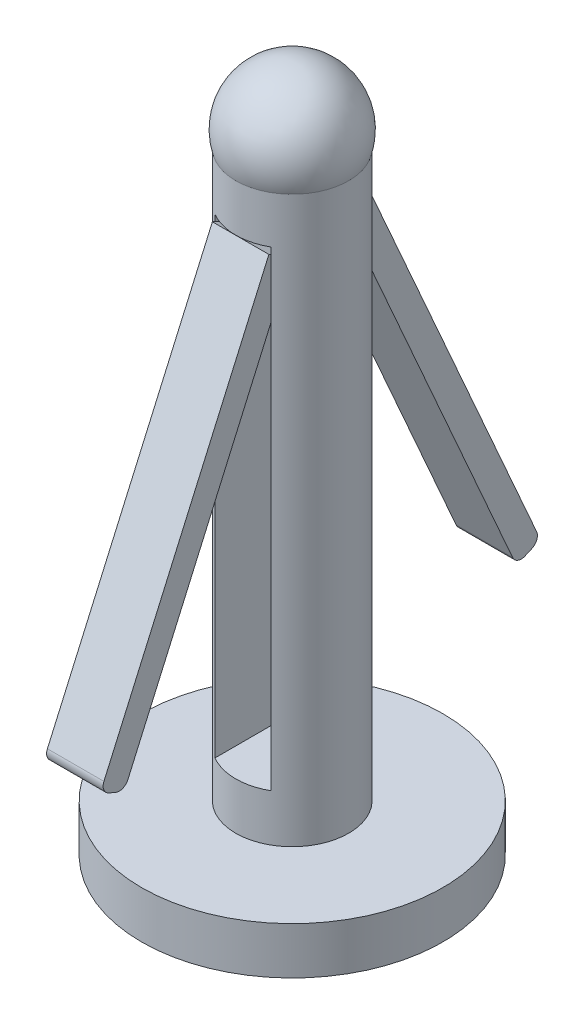
ISO-10303-21;
HEADER;
FILE_DESCRIPTION(('STEP AP214'),'2;1');
FILE_NAME('part.step','',(''),(''),'','','');
FILE_SCHEMA(('AUTOMOTIVE_DESIGN { 1 0 10303 214 1 1 1 1 }'));
ENDSEC;
DATA;
#1=APPLICATION_CONTEXT('core data for automotive mechanical design processes');
#2=APPLICATION_PROTOCOL_DEFINITION('international standard','automotive_design',2000,#1);
#3=PRODUCT_CONTEXT('',#1,'mechanical');
#4=PRODUCT('Part','Part','',(#3));
#5=PRODUCT_RELATED_PRODUCT_CATEGORY('part','',(#4));
#6=PRODUCT_DEFINITION_FORMATION('','',#4);
#7=PRODUCT_DEFINITION_CONTEXT('part definition',#1,'design');
#8=PRODUCT_DEFINITION('design','',#6,#7);
#9=PRODUCT_DEFINITION_SHAPE('','',#8);
#10=(LENGTH_UNIT() NAMED_UNIT(*) SI_UNIT(.MILLI.,.METRE.));
#11=(NAMED_UNIT(*) PLANE_ANGLE_UNIT() SI_UNIT($,.RADIAN.));
#12=(NAMED_UNIT(*) SI_UNIT($,.STERADIAN.) SOLID_ANGLE_UNIT());
#13=UNCERTAINTY_MEASURE_WITH_UNIT(LENGTH_MEASURE(1.E-05),#10,'distance_accuracy_value','');
#14=(GEOMETRIC_REPRESENTATION_CONTEXT(3) GLOBAL_UNCERTAINTY_ASSIGNED_CONTEXT((#13)) GLOBAL_UNIT_ASSIGNED_CONTEXT((#10,
#11,#12)) REPRESENTATION_CONTEXT('',''));
#15=CARTESIAN_POINT('',(0.,0.,0.));
#16=DIRECTION('',(0.,0.,1.));
#17=DIRECTION('',(1.,0.,0.));
#18=AXIS2_PLACEMENT_3D('',#15,#16,#17);
#19=CARTESIAN_POINT('',(-3.0237591290621,14.0271805623324,-21.346207791417));
#20=DIRECTION('',(1.,0.,0.));
#21=DIRECTION('',(0.,1.,0.));
#22=AXIS2_PLACEMENT_3D('',#19,#20,#21);
#23=CYLINDRICAL_SURFACE('',#22,1.);
#24=DIRECTION('',(1.,0.,0.));
#25=VECTOR('',#24,1.);
#26=CARTESIAN_POINT('',(-3.0237591290621,13.6235064220948,-20.4313049613288));
#27=LINE('',#26,#25);
#28=CARTESIAN_POINT('',(-3.0237591290621,13.6235064220948,-20.4313049613288));
#29=VERTEX_POINT('',#28);
#30=CARTESIAN_POINT('',(2.9762408709379,13.6235064220948,-20.4313049613288));
#31=VERTEX_POINT('',#30);
#32=EDGE_CURVE('E326',#29,#31,#27,.T.);
#33=ORIENTED_EDGE('',*,*,#32,.F.);
#34=CARTESIAN_POINT('',(-3.0237591290621,14.0271805623324,-21.346207791417));
#35=DIRECTION('',(1.,0.,0.));
#36=DIRECTION('',(0.,1.,0.));
#37=AXIS2_PLACEMENT_3D('',#34,#35,#36);
#38=CIRCLE('',#37,1.);
#39=CARTESIAN_POINT('',(-3.0237591290621,13.1122777322441,-21.7498819316545));
#40=VERTEX_POINT('',#39);
#41=EDGE_CURVE('E41',#40,#29,#38,.F.);
#42=ORIENTED_EDGE('',*,*,#41,.F.);
#43=DIRECTION('',(1.,0.,0.));
#44=VECTOR('',#43,1.);
#45=CARTESIAN_POINT('',(-3.0237591290621,13.1122777322441,-21.7498819316545));
#46=LINE('',#45,#44);
#47=CARTESIAN_POINT('',(2.9762408709379,13.1122777322441,-21.7498819316545));
#48=VERTEX_POINT('',#47);
#49=EDGE_CURVE('E329',#48,#40,#46,.F.);
#50=ORIENTED_EDGE('',*,*,#49,.F.);
#51=CARTESIAN_POINT('',(2.9762408709379,14.0271805623324,-21.346207791417));
#52=DIRECTION('',(1.,0.,0.));
#53=DIRECTION('',(0.,1.,0.));
#54=AXIS2_PLACEMENT_3D('',#51,#52,#53);
#55=CIRCLE('',#54,1.);
#56=EDGE_CURVE('E11',#31,#48,#55,.T.);
#57=ORIENTED_EDGE('',*,*,#56,.F.);
#58=EDGE_LOOP('',(#33,#42,#50,#57));
#59=FACE_BOUND('',#58,.T.);
#60=ADVANCED_FACE('F34',(#59),#23,.T.);
#61=CARTESIAN_POINT('',(-3.0237591290621,14.3406013358795,-22.0565568679222));
#62=DIRECTION('',(-1.,0.,0.));
#63=DIRECTION('',(0.,-1.,0.));
#64=AXIS2_PLACEMENT_3D('',#61,#62,#63);
#65=CYLINDRICAL_SURFACE('',#64,1.);
#66=DIRECTION('',(-1.,0.,0.));
#67=VECTOR('',#66,1.);
#68=CARTESIAN_POINT('',(-3.0237591290621,14.7442754761171,-22.9714596980105));
#69=LINE('',#68,#67);
#70=CARTESIAN_POINT('',(2.9762408709379,14.7442754761171,-22.9714596980105));
#71=VERTEX_POINT('',#70);
#72=CARTESIAN_POINT('',(-3.0237591290621,14.7442754761171,-22.9714596980105));
#73=VERTEX_POINT('',#72);
#74=EDGE_CURVE('E315',#71,#73,#69,.T.);
#75=ORIENTED_EDGE('',*,*,#74,.F.);
#76=CARTESIAN_POINT('',(2.9762408709379,14.3406013358795,-22.0565568679222));
#77=DIRECTION('',(1.,0.,0.));
#78=DIRECTION('',(0.,1.,0.));
#79=AXIS2_PLACEMENT_3D('',#76,#77,#78);
#80=CIRCLE('',#79,1.);
#81=CARTESIAN_POINT('',(2.9762408709379,13.4256985057913,-22.4602310081598));
#82=VERTEX_POINT('',#81);
#83=EDGE_CURVE('E321',#82,#71,#80,.T.);
#84=ORIENTED_EDGE('',*,*,#83,.F.);
#85=DIRECTION('',(-1.,0.,0.));
#86=VECTOR('',#85,1.);
#87=CARTESIAN_POINT('',(-3.0237591290621,13.4256985057913,-22.4602310081598));
#88=LINE('',#87,#86);
#89=CARTESIAN_POINT('',(-3.0237591290621,13.4256985057913,-22.4602310081598));
#90=VERTEX_POINT('',#89);
#91=EDGE_CURVE('E318',#90,#82,#88,.F.);
#92=ORIENTED_EDGE('',*,*,#91,.F.);
#93=CARTESIAN_POINT('',(-3.0237591290621,14.3406013358795,-22.0565568679222));
#94=DIRECTION('',(1.,0.,0.));
#95=DIRECTION('',(0.,1.,0.));
#96=AXIS2_PLACEMENT_3D('',#93,#94,#95);
#97=CIRCLE('',#96,1.);
#98=EDGE_CURVE('E323',#73,#90,#97,.F.);
#99=ORIENTED_EDGE('',*,*,#98,.F.);
#100=EDGE_LOOP('',(#75,#84,#92,#99));
#101=FACE_BOUND('',#100,.T.);
#102=ADVANCED_FACE('F404',(#101),#65,.T.);
#103=CARTESIAN_POINT('',(-3.0237591290621,14.0271805623324,21.346207791417));
#104=DIRECTION('',(-1.,0.,0.));
#105=DIRECTION('',(0.,-1.,0.));
#106=AXIS2_PLACEMENT_3D('',#103,#104,#105);
#107=CYLINDRICAL_SURFACE('',#106,1.);
#108=DIRECTION('',(-1.,0.,0.));
#109=VECTOR('',#108,1.);
#110=CARTESIAN_POINT('',(-3.0237591290621,13.6235064220948,20.4313049613288));
#111=LINE('',#110,#109);
#112=CARTESIAN_POINT('',(2.9762408709379,13.6235064220948,20.4313049613288));
#113=VERTEX_POINT('',#112);
#114=CARTESIAN_POINT('',(-3.0237591290621,13.6235064220948,20.4313049613288));
#115=VERTEX_POINT('',#114);
#116=EDGE_CURVE('E305',#113,#115,#111,.T.);
#117=ORIENTED_EDGE('',*,*,#116,.F.);
#118=CARTESIAN_POINT('',(2.9762408709379,14.0271805623324,21.346207791417));
#119=DIRECTION('',(1.,0.,0.));
#120=DIRECTION('',(0.,1.,0.));
#121=AXIS2_PLACEMENT_3D('',#118,#119,#120);
#122=CIRCLE('',#121,1.);
#123=CARTESIAN_POINT('',(2.9762408709379,13.1122777322441,21.7498819316545));
#124=VERTEX_POINT('',#123);
#125=EDGE_CURVE('E311',#124,#113,#122,.T.);
#126=ORIENTED_EDGE('',*,*,#125,.F.);
#127=DIRECTION('',(-1.,0.,0.));
#128=VECTOR('',#127,1.);
#129=CARTESIAN_POINT('',(-3.0237591290621,13.1122777322441,21.7498819316545));
#130=LINE('',#129,#128);
#131=CARTESIAN_POINT('',(-3.0237591290621,13.1122777322441,21.7498819316545));
#132=VERTEX_POINT('',#131);
#133=EDGE_CURVE('E308',#132,#124,#130,.F.);
#134=ORIENTED_EDGE('',*,*,#133,.F.);
#135=CARTESIAN_POINT('',(-3.0237591290621,14.0271805623324,21.346207791417));
#136=DIRECTION('',(1.,0.,0.));
#137=DIRECTION('',(0.,1.,0.));
#138=AXIS2_PLACEMENT_3D('',#135,#136,#137);
#139=CIRCLE('',#138,1.);
#140=EDGE_CURVE('E313',#115,#132,#139,.F.);
#141=ORIENTED_EDGE('',*,*,#140,.F.);
#142=EDGE_LOOP('',(#117,#126,#134,#141));
#143=FACE_BOUND('',#142,.T.);
#144=ADVANCED_FACE('F379',(#143),#107,.T.);
#145=CARTESIAN_POINT('',(-3.0237591290621,14.3406013358795,22.0565568679222));
#146=DIRECTION('',(1.,0.,0.));
#147=DIRECTION('',(0.,1.,0.));
#148=AXIS2_PLACEMENT_3D('',#145,#146,#147);
#149=CYLINDRICAL_SURFACE('',#148,1.);
#150=DIRECTION('',(1.,0.,0.));
#151=VECTOR('',#150,1.);
#152=CARTESIAN_POINT('',(-3.0237591290621,14.7442754761171,22.9714596980105));
#153=LINE('',#152,#151);
#154=CARTESIAN_POINT('',(-3.0237591290621,14.7442754761171,22.9714596980105));
#155=VERTEX_POINT('',#154);
#156=CARTESIAN_POINT('',(2.9762408709379,14.7442754761171,22.9714596980105));
#157=VERTEX_POINT('',#156);
#158=EDGE_CURVE('E294',#155,#157,#153,.T.);
#159=ORIENTED_EDGE('',*,*,#158,.F.);
#160=CARTESIAN_POINT('',(-3.0237591290621,14.3406013358795,22.0565568679222));
#161=DIRECTION('',(1.,0.,0.));
#162=DIRECTION('',(0.,1.,0.));
#163=AXIS2_PLACEMENT_3D('',#160,#161,#162);
#164=CIRCLE('',#163,1.);
#165=CARTESIAN_POINT('',(-3.0237591290621,13.4256985057913,22.4602310081598));
#166=VERTEX_POINT('',#165);
#167=EDGE_CURVE('E300',#166,#155,#164,.F.);
#168=ORIENTED_EDGE('',*,*,#167,.F.);
#169=DIRECTION('',(1.,0.,0.));
#170=VECTOR('',#169,1.);
#171=CARTESIAN_POINT('',(-3.0237591290621,13.4256985057913,22.4602310081598));
#172=LINE('',#171,#170);
#173=CARTESIAN_POINT('',(2.9762408709379,13.4256985057913,22.4602310081598));
#174=VERTEX_POINT('',#173);
#175=EDGE_CURVE('E297',#174,#166,#172,.F.);
#176=ORIENTED_EDGE('',*,*,#175,.F.);
#177=CARTESIAN_POINT('',(2.9762408709379,14.3406013358795,22.0565568679222));
#178=DIRECTION('',(1.,0.,0.));
#179=DIRECTION('',(0.,1.,0.));
#180=AXIS2_PLACEMENT_3D('',#177,#178,#179);
#181=CIRCLE('',#180,1.);
#182=EDGE_CURVE('E302',#157,#174,#181,.T.);
#183=ORIENTED_EDGE('',*,*,#182,.F.);
#184=EDGE_LOOP('',(#159,#168,#176,#183));
#185=FACE_BOUND('',#184,.T.);
#186=ADVANCED_FACE('F372',(#185),#149,.T.);
#187=CARTESIAN_POINT('',(-3.0237591290621,55.,-6.));
#188=DIRECTION('',(-1.,0.,0.));
#189=DIRECTION('',(0.,-1.,0.));
#190=AXIS2_PLACEMENT_3D('',#187,#188,#189);
#191=PLANE('',#190);
#192=DIRECTION('',(0.,-1.,0.));
#193=VECTOR('',#192,1.);
#194=CARTESIAN_POINT('',(-3.0237591290621,60.,-5.18236246603936));
#195=LINE('',#194,#193);
#196=CARTESIAN_POINT('',(-3.0237591290621,48.1843049824975,-5.18236246603936));
#197=VERTEX_POINT('',#196);
#198=CARTESIAN_POINT('',(-3.0237591290621,5.,-5.18236246603937));
#199=VERTEX_POINT('',#198);
#200=EDGE_CURVE('E196',#197,#199,#195,.T.);
#201=ORIENTED_EDGE('',*,*,#200,.F.);
#202=DIRECTION('',(0.,-0.914902830088248,-0.403674140237536));
#203=VECTOR('',#202,1.);
#204=CARTESIAN_POINT('',(-3.0237591290621,12.7086035920066,-20.8349791015663));
#205=LINE('',#204,#203);
#206=CARTESIAN_POINT('',(-3.0237591290621,53.3243296930876,-2.91447675445292));
#207=VERTEX_POINT('',#206);
#208=EDGE_CURVE('E180',#207,#197,#205,.T.);
#209=ORIENTED_EDGE('',*,*,#208,.F.);
#210=DIRECTION('',(0.,-0.403674140237535,0.914902830088249));
#211=VECTOR('',#210,1.);
#212=CARTESIAN_POINT('',(-3.0237591290621,54.4450987471099,-5.45463149113464));
#213=LINE('',#212,#211);
#214=CARTESIAN_POINT('',(-3.0237591290621,54.3249679955108,-5.18236246603936));
#215=VERTEX_POINT('',#214);
#216=EDGE_CURVE('E167',#215,#207,#213,.T.);
#217=ORIENTED_EDGE('',*,*,#216,.F.);
#218=CARTESIAN_POINT('',(-3.0237591290621,55.,-5.18236246603936));
#219=VERTEX_POINT('',#218);
#220=EDGE_CURVE('E278',#219,#215,#195,.T.);
#221=ORIENTED_EDGE('',*,*,#220,.F.);
#222=DIRECTION('',(0.,0.,1.));
#223=VECTOR('',#222,1.);
#224=CARTESIAN_POINT('',(-3.0237591290621,55.,-6.));
#225=LINE('',#224,#223);
#226=CARTESIAN_POINT('',(-3.0237591290621,55.,5.18236246603936));
#227=VERTEX_POINT('',#226);
#228=EDGE_CURVE('E244',#219,#227,#225,.T.);
#229=ORIENTED_EDGE('',*,*,#228,.T.);
#230=DIRECTION('',(0.,-1.,0.));
#231=VECTOR('',#230,1.);
#232=CARTESIAN_POINT('',(-3.0237591290621,60.,5.18236246603936));
#233=LINE('',#232,#231);
#234=CARTESIAN_POINT('',(-3.0237591290621,54.3249679955108,5.18236246603937));
#235=VERTEX_POINT('',#234);
#236=EDGE_CURVE('E272',#235,#227,#233,.F.);
#237=ORIENTED_EDGE('',*,*,#236,.F.);
#238=DIRECTION('',(0.,-0.403674140237535,-0.914902830088249));
#239=VECTOR('',#238,1.);
#240=CARTESIAN_POINT('',(-3.0237591290621,54.4450987471099,5.45463149113464));
#241=LINE('',#240,#239);
#242=CARTESIAN_POINT('',(-3.0237591290621,53.3243296930876,2.91447675445292));
#243=VERTEX_POINT('',#242);
#244=EDGE_CURVE('E221',#235,#243,#241,.T.);
#245=ORIENTED_EDGE('',*,*,#244,.T.);
#246=DIRECTION('',(0.,-0.914902830088248,0.403674140237536));
#247=VECTOR('',#246,1.);
#248=CARTESIAN_POINT('',(-3.0237591290621,12.7086035920066,20.8349791015663));
#249=LINE('',#248,#247);
#250=CARTESIAN_POINT('',(-3.0237591290621,48.1843049824975,5.18236246603936));
#251=VERTEX_POINT('',#250);
#252=EDGE_CURVE('E226',#243,#251,#249,.T.);
#253=ORIENTED_EDGE('',*,*,#252,.T.);
#254=CARTESIAN_POINT('',(-3.0237591290621,5.,5.18236246603937));
#255=VERTEX_POINT('',#254);
#256=EDGE_CURVE('E274',#255,#251,#233,.F.);
#257=ORIENTED_EDGE('',*,*,#256,.F.);
#258=DIRECTION('',(0.,0.,1.));
#259=VECTOR('',#258,1.);
#260=CARTESIAN_POINT('',(-3.0237591290621,5.,-6.));
#261=LINE('',#260,#259);
#262=EDGE_CURVE('E243',#199,#255,#261,.T.);
#263=ORIENTED_EDGE('',*,*,#262,.F.);
#264=EDGE_LOOP('',(#201,#209,#217,#221,#229,#237,#245,#253,#257,#263));
#265=FACE_BOUND('',#264,.T.);
#266=ADVANCED_FACE('F194',(#265),#191,.F.);
#267=CARTESIAN_POINT('',(2.9762408709379,55.,-6.));
#268=DIRECTION('',(1.,0.,0.));
#269=DIRECTION('',(0.,1.,0.));
#270=AXIS2_PLACEMENT_3D('',#267,#268,#269);
#271=PLANE('',#270);
#272=DIRECTION('',(0.,-0.403674140237535,0.914902830088249));
#273=VECTOR('',#272,1.);
#274=CARTESIAN_POINT('',(2.9762408709379,54.4450987471099,-5.45463149113464));
#275=LINE('',#274,#273);
#276=CARTESIAN_POINT('',(2.9762408709379,54.3370729147514,-5.2097975275589));
#277=VERTEX_POINT('',#276);
#278=CARTESIAN_POINT('',(2.9762408709379,53.3243296930876,-2.91447675445292));
#279=VERTEX_POINT('',#278);
#280=EDGE_CURVE('E209',#277,#279,#275,.T.);
#281=ORIENTED_EDGE('',*,*,#280,.T.);
#282=DIRECTION('',(0.,-0.914902830088248,-0.403674140237536));
#283=VECTOR('',#282,1.);
#284=CARTESIAN_POINT('',(2.9762408709379,12.7086035920066,-20.8349791015663));
#285=LINE('',#284,#283);
#286=CARTESIAN_POINT('',(2.9762408709379,48.1221250880581,-5.20979752755891));
#287=VERTEX_POINT('',#286);
#288=EDGE_CURVE('E188',#279,#287,#285,.T.);
#289=ORIENTED_EDGE('',*,*,#288,.T.);
#290=DIRECTION('',(0.,-1.,0.));
#291=VECTOR('',#290,1.);
#292=CARTESIAN_POINT('',(2.9762408709379,60.,-5.2097975275589));
#293=LINE('',#292,#291);
#294=CARTESIAN_POINT('',(2.9762408709379,5.,-5.2097975275589));
#295=VERTEX_POINT('',#294);
#296=EDGE_CURVE('E287',#295,#287,#293,.F.);
#297=ORIENTED_EDGE('',*,*,#296,.F.);
#298=DIRECTION('',(0.,0.,1.));
#299=VECTOR('',#298,1.);
#300=CARTESIAN_POINT('',(2.9762408709379,5.,-6.));
#301=LINE('',#300,#299);
#302=CARTESIAN_POINT('',(2.9762408709379,5.,5.2097975275589));
#303=VERTEX_POINT('',#302);
#304=EDGE_CURVE('E251',#295,#303,#301,.T.);
#305=ORIENTED_EDGE('',*,*,#304,.T.);
#306=DIRECTION('',(0.,-1.,0.));
#307=VECTOR('',#306,1.);
#308=CARTESIAN_POINT('',(2.9762408709379,60.,5.2097975275589));
#309=LINE('',#308,#307);
#310=CARTESIAN_POINT('',(2.9762408709379,48.1221250880582,5.2097975275589));
#311=VERTEX_POINT('',#310);
#312=EDGE_CURVE('E280',#311,#303,#309,.T.);
#313=ORIENTED_EDGE('',*,*,#312,.F.);
#314=DIRECTION('',(0.,-0.914902830088248,0.403674140237536));
#315=VECTOR('',#314,1.);
#316=CARTESIAN_POINT('',(2.9762408709379,12.7086035920066,20.8349791015663));
#317=LINE('',#316,#315);
#318=CARTESIAN_POINT('',(2.9762408709379,53.3243296930876,2.91447675445292));
#319=VERTEX_POINT('',#318);
#320=EDGE_CURVE('E219',#319,#311,#317,.T.);
#321=ORIENTED_EDGE('',*,*,#320,.F.);
#322=DIRECTION('',(0.,-0.403674140237536,-0.914902830088249));
#323=VECTOR('',#322,1.);
#324=CARTESIAN_POINT('',(2.9762408709379,50.3050670292558,-3.92849801300188));
#325=LINE('',#324,#323);
#326=CARTESIAN_POINT('',(2.9762408709379,54.3370729147514,5.20979752755891));
#327=VERTEX_POINT('',#326);
#328=EDGE_CURVE('E290',#327,#319,#325,.T.);
#329=ORIENTED_EDGE('',*,*,#328,.F.);
#330=CARTESIAN_POINT('',(2.9762408709379,55.,5.2097975275589));
#331=VERTEX_POINT('',#330);
#332=EDGE_CURVE('E282',#331,#327,#309,.T.);
#333=ORIENTED_EDGE('',*,*,#332,.F.);
#334=DIRECTION('',(0.,0.,1.));
#335=VECTOR('',#334,1.);
#336=CARTESIAN_POINT('',(2.9762408709379,55.,-6.));
#337=LINE('',#336,#335);
#338=CARTESIAN_POINT('',(2.9762408709379,55.,-5.2097975275589));
#339=VERTEX_POINT('',#338);
#340=EDGE_CURVE('E248',#339,#331,#337,.T.);
#341=ORIENTED_EDGE('',*,*,#340,.F.);
#342=EDGE_CURVE('E285',#277,#339,#293,.F.);
#343=ORIENTED_EDGE('',*,*,#342,.F.);
#344=EDGE_LOOP('',(#281,#289,#297,#305,#313,#321,#329,#333,#341,#343));
#345=FACE_BOUND('',#344,.T.);
#346=ADVANCED_FACE('F348',(#345),#271,.F.);
#347=CARTESIAN_POINT('',(0.,0.,0.));
#348=DIRECTION('',(0.,1.,0.));
#349=DIRECTION('',(0.,0.,1.));
#350=AXIS2_PLACEMENT_3D('',#347,#348,#349);
#351=PLANE('',#350);
#352=CARTESIAN_POINT('',(0.,0.,0.));
#353=DIRECTION('',(0.,1.,0.));
#354=DIRECTION('',(0.,0.,1.));
#355=AXIS2_PLACEMENT_3D('',#352,#353,#354);
#356=CIRCLE('',#355,16.);
#357=CARTESIAN_POINT('',(0.,0.,16.));
#358=VERTEX_POINT('',#357);
#359=EDGE_CURVE('E262',#358,#358,#356,.T.);
#360=ORIENTED_EDGE('',*,*,#359,.T.);
#361=EDGE_LOOP('',(#360));
#362=FACE_BOUND('',#361,.T.);
#363=CARTESIAN_POINT('',(0.,0.,0.));
#364=DIRECTION('',(0.,1.,0.));
#365=DIRECTION('',(0.,0.,1.));
#366=AXIS2_PLACEMENT_3D('',#363,#364,#365);
#367=CIRCLE('',#366,6.);
#368=CARTESIAN_POINT('',(0.,0.,6.));
#369=VERTEX_POINT('',#368);
#370=EDGE_CURVE('E247',#369,#369,#367,.T.);
#371=ORIENTED_EDGE('',*,*,#370,.F.);
#372=EDGE_LOOP('',(#371));
#373=FACE_BOUND('',#372,.T.);
#374=ADVANCED_FACE('F436',(#362,#373),#351,.T.);
#375=CARTESIAN_POINT('',(0.,-5.,0.));
#376=DIRECTION('',(0.,1.,0.));
#377=DIRECTION('',(0.,0.,1.));
#378=AXIS2_PLACEMENT_3D('',#375,#376,#377);
#379=CYLINDRICAL_SURFACE('',#378,16.);
#380=CARTESIAN_POINT('',(0.,-5.,0.));
#381=DIRECTION('',(0.,1.,0.));
#382=DIRECTION('',(0.,0.,1.));
#383=AXIS2_PLACEMENT_3D('',#380,#381,#382);
#384=CIRCLE('',#383,16.);
#385=CARTESIAN_POINT('',(0.,-5.,16.));
#386=VERTEX_POINT('',#385);
#387=EDGE_CURVE('E258',#386,#386,#384,.T.);
#388=ORIENTED_EDGE('',*,*,#387,.T.);
#389=EDGE_LOOP('',(#388));
#390=FACE_BOUND('',#389,.T.);
#391=ORIENTED_EDGE('',*,*,#359,.F.);
#392=EDGE_LOOP('',(#391));
#393=FACE_BOUND('',#392,.T.);
#394=ADVANCED_FACE('F432',(#390,#393),#379,.T.);
#395=CARTESIAN_POINT('',(0.,-5.,0.));
#396=DIRECTION('',(0.,1.,0.));
#397=DIRECTION('',(0.,0.,1.));
#398=AXIS2_PLACEMENT_3D('',#395,#396,#397);
#399=PLANE('',#398);
#400=ORIENTED_EDGE('',*,*,#387,.F.);
#401=EDGE_LOOP('',(#400));
#402=FACE_BOUND('',#401,.T.);
#403=ADVANCED_FACE('F435',(#402),#399,.F.);
#404=CARTESIAN_POINT('',(0.,60.,0.));
#405=DIRECTION('',(0.,-1.,0.));
#406=DIRECTION('',(0.,0.,-1.));
#407=AXIS2_PLACEMENT_3D('',#404,#405,#406);
#408=CYLINDRICAL_SURFACE('',#407,6.);
#409=ORIENTED_EDGE('',*,*,#296,.T.);
#410=EDGE_CURVE('E291',#287,#277,#293,.F.);
#411=ORIENTED_EDGE('',*,*,#410,.T.);
#412=ORIENTED_EDGE('',*,*,#342,.T.);
#413=CARTESIAN_POINT('',(0.,55.,0.));
#414=DIRECTION('',(0.,1.,0.));
#415=DIRECTION('',(0.,0.,1.));
#416=AXIS2_PLACEMENT_3D('',#413,#414,#415);
#417=CIRCLE('',#416,6.);
#418=EDGE_CURVE('E273',#339,#219,#417,.T.);
#419=ORIENTED_EDGE('',*,*,#418,.T.);
#420=ORIENTED_EDGE('',*,*,#220,.T.);
#421=EDGE_CURVE('E281',#215,#197,#195,.T.);
#422=ORIENTED_EDGE('',*,*,#421,.T.);
#423=ORIENTED_EDGE('',*,*,#200,.T.);
#424=CARTESIAN_POINT('',(0.,5.,0.));
#425=DIRECTION('',(0.,-1.,0.));
#426=DIRECTION('',(0.,0.,-1.));
#427=AXIS2_PLACEMENT_3D('',#424,#425,#426);
#428=CIRCLE('',#427,6.);
#429=EDGE_CURVE('E270',#199,#295,#428,.T.);
#430=ORIENTED_EDGE('',*,*,#429,.T.);
#431=EDGE_LOOP('',(#409,#411,#412,#419,#420,#422,#423,#430));
#432=FACE_BOUND('',#431,.T.);
#433=EDGE_CURVE('E269',#227,#331,#417,.T.);
#434=ORIENTED_EDGE('',*,*,#433,.T.);
#435=ORIENTED_EDGE('',*,*,#332,.T.);
#436=EDGE_CURVE('E286',#327,#311,#309,.T.);
#437=ORIENTED_EDGE('',*,*,#436,.T.);
#438=ORIENTED_EDGE('',*,*,#312,.T.);
#439=EDGE_CURVE('E261',#303,#255,#428,.T.);
#440=ORIENTED_EDGE('',*,*,#439,.T.);
#441=ORIENTED_EDGE('',*,*,#256,.T.);
#442=EDGE_CURVE('E277',#251,#235,#233,.F.);
#443=ORIENTED_EDGE('',*,*,#442,.T.);
#444=ORIENTED_EDGE('',*,*,#236,.T.);
#445=EDGE_LOOP('',(#434,#435,#437,#438,#440,#441,#443,#444));
#446=FACE_BOUND('',#445,.T.);
#447=CARTESIAN_POINT('',(0.,60.,0.));
#448=DIRECTION('',(0.,1.,0.));
#449=DIRECTION('',(0.,0.,1.));
#450=AXIS2_PLACEMENT_3D('',#447,#448,#449);
#451=CIRCLE('',#450,6.);
#452=CARTESIAN_POINT('',(0.,60.,6.));
#453=VERTEX_POINT('',#452);
#454=EDGE_CURVE('E257',#453,#453,#451,.T.);
#455=ORIENTED_EDGE('',*,*,#454,.F.);
#456=EDGE_LOOP('',(#455));
#457=FACE_BOUND('',#456,.T.);
#458=ORIENTED_EDGE('',*,*,#370,.T.);
#459=EDGE_LOOP('',(#458));
#460=FACE_BOUND('',#459,.T.);
#461=ADVANCED_FACE('F339',(#432,#446,#457,#460),#408,.T.);
#462=CARTESIAN_POINT('',(0.,61.75,0.));
#463=DIRECTION('',(0.,0.,1.));
#464=DIRECTION('',(1.,0.,0.));
#465=AXIS2_PLACEMENT_3D('',#462,#463,#464);
#466=SPHERICAL_SURFACE('',#465,6.25);
#467=CARTESIAN_POINT('',(0.,61.75,0.));
#468=DIRECTION('',(0.,1.,0.));
#469=DIRECTION('',(0.,0.,1.));
#470=AXIS2_PLACEMENT_3D('',#467,#468,#469);
#471=SPHERICAL_SURFACE('',#470,6.25);
#472=ORIENTED_EDGE('',*,*,#454,.T.);
#473=EDGE_LOOP('',(#472));
#474=FACE_BOUND('',#473,.T.);
#475=ADVANCED_FACE('F428',(#474),#471,.T.);
#476=CARTESIAN_POINT('',(2.9762408709379,55.,-6.));
#477=DIRECTION('',(0.,1.,0.));
#478=DIRECTION('',(0.,0.,1.));
#479=AXIS2_PLACEMENT_3D('',#476,#477,#478);
#480=PLANE('',#479);
#481=ORIENTED_EDGE('',*,*,#340,.T.);
#482=ORIENTED_EDGE('',*,*,#433,.F.);
#483=ORIENTED_EDGE('',*,*,#228,.F.);
#484=ORIENTED_EDGE('',*,*,#418,.F.);
#485=EDGE_LOOP('',(#481,#482,#483,#484));
#486=FACE_BOUND('',#485,.T.);
#487=ADVANCED_FACE('F345',(#486),#480,.F.);
#488=CARTESIAN_POINT('',(2.9762408709379,5.,-6.));
#489=DIRECTION('',(0.,-1.,0.));
#490=DIRECTION('',(0.,0.,-1.));
#491=AXIS2_PLACEMENT_3D('',#488,#489,#490);
#492=PLANE('',#491);
#493=ORIENTED_EDGE('',*,*,#304,.F.);
#494=ORIENTED_EDGE('',*,*,#429,.F.);
#495=ORIENTED_EDGE('',*,*,#262,.T.);
#496=ORIENTED_EDGE('',*,*,#439,.F.);
#497=EDGE_LOOP('',(#493,#494,#495,#496));
#498=FACE_BOUND('',#497,.T.);
#499=ADVANCED_FACE('F389',(#498),#492,.F.);
#500=CARTESIAN_POINT('',(-3.0237591290621,0.,0.));
#501=DIRECTION('',(1.,0.,0.));
#502=DIRECTION('',(0.,1.,0.));
#503=AXIS2_PLACEMENT_3D('',#500,#501,#502);
#504=PLANE('',#503);
#505=EDGE_CURVE('E225',#251,#115,#249,.T.);
#506=ORIENTED_EDGE('',*,*,#505,.T.);
#507=ORIENTED_EDGE('',*,*,#140,.T.);
#508=DIRECTION('',(0.,0.403674140237536,0.914902830088248));
#509=VECTOR('',#508,1.);
#510=CARTESIAN_POINT('',(-3.0237591290621,13.8293726460288,23.375133838248));
#511=LINE('',#510,#509);
#512=EDGE_CURVE('E216',#132,#166,#511,.T.);
#513=ORIENTED_EDGE('',*,*,#512,.T.);
#514=ORIENTED_EDGE('',*,*,#167,.T.);
#515=DIRECTION('',(0.,0.914902830088248,-0.403674140237536));
#516=VECTOR('',#515,1.);
#517=CARTESIAN_POINT('',(-3.0237591290621,54.4450987471099,5.45463149113464));
#518=LINE('',#517,#516);
#519=CARTESIAN_POINT('',(-3.0237591290621,54.4450987471099,5.45463149113464));
#520=VERTEX_POINT('',#519);
#521=EDGE_CURVE('E218',#155,#520,#518,.T.);
#522=ORIENTED_EDGE('',*,*,#521,.T.);
#523=EDGE_CURVE('E222',#520,#235,#241,.T.);
#524=ORIENTED_EDGE('',*,*,#523,.T.);
#525=ORIENTED_EDGE('',*,*,#442,.F.);
#526=EDGE_LOOP('',(#506,#507,#513,#514,#522,#524,#525));
#527=FACE_BOUND('',#526,.T.);
#528=ADVANCED_FACE('F395',(#527),#504,.F.);
#529=CARTESIAN_POINT('',(2.9762408709379,0.,0.));
#530=DIRECTION('',(1.,0.,0.));
#531=DIRECTION('',(0.,1.,0.));
#532=AXIS2_PLACEMENT_3D('',#529,#530,#531);
#533=PLANE('',#532);
#534=DIRECTION('',(0.,0.403674140237536,0.914902830088248));
#535=VECTOR('',#534,1.);
#536=CARTESIAN_POINT('',(2.9762408709379,13.8293726460288,23.375133838248));
#537=LINE('',#536,#535);
#538=EDGE_CURVE('E190',#124,#174,#537,.T.);
#539=ORIENTED_EDGE('',*,*,#538,.F.);
#540=ORIENTED_EDGE('',*,*,#125,.T.);
#541=EDGE_CURVE('E235',#311,#113,#317,.T.);
#542=ORIENTED_EDGE('',*,*,#541,.F.);
#543=ORIENTED_EDGE('',*,*,#436,.F.);
#544=DIRECTION('',(0.,-0.403674140237535,-0.914902830088249));
#545=VECTOR('',#544,1.);
#546=CARTESIAN_POINT('',(2.9762408709379,54.4450987471099,5.45463149113464));
#547=LINE('',#546,#545);
#548=CARTESIAN_POINT('',(2.9762408709379,54.4450987471099,5.45463149113464));
#549=VERTEX_POINT('',#548);
#550=EDGE_CURVE('E232',#549,#327,#547,.T.);
#551=ORIENTED_EDGE('',*,*,#550,.F.);
#552=DIRECTION('',(0.,0.914902830088248,-0.403674140237536));
#553=VECTOR('',#552,1.);
#554=CARTESIAN_POINT('',(2.9762408709379,54.4450987471099,5.45463149113464));
#555=LINE('',#554,#553);
#556=EDGE_CURVE('E230',#157,#549,#555,.T.);
#557=ORIENTED_EDGE('',*,*,#556,.F.);
#558=ORIENTED_EDGE('',*,*,#182,.T.);
#559=EDGE_LOOP('',(#539,#540,#542,#543,#551,#557,#558));
#560=FACE_BOUND('',#559,.T.);
#561=ADVANCED_FACE('F356',(#560),#533,.T.);
#562=CARTESIAN_POINT('',(-3.0237591290621,13.8293726460288,23.375133838248));
#563=DIRECTION('',(0.,0.914902830088248,-0.403674140237536));
#564=DIRECTION('',(0.,0.403674140237536,0.914902830088248));
#565=AXIS2_PLACEMENT_3D('',#562,#563,#564);
#566=PLANE('',#565);
#567=ORIENTED_EDGE('',*,*,#512,.F.);
#568=ORIENTED_EDGE('',*,*,#133,.T.);
#569=ORIENTED_EDGE('',*,*,#538,.T.);
#570=ORIENTED_EDGE('',*,*,#175,.T.);
#571=EDGE_LOOP('',(#567,#568,#569,#570));
#572=FACE_BOUND('',#571,.T.);
#573=ADVANCED_FACE('F375',(#572),#566,.F.);
#574=CARTESIAN_POINT('',(-3.0237591290621,54.4450987471099,5.45463149113464));
#575=DIRECTION('',(0.,-0.403674140237536,-0.914902830088248));
#576=DIRECTION('',(0.,0.914902830088248,-0.403674140237536));
#577=AXIS2_PLACEMENT_3D('',#574,#575,#576);
#578=PLANE('',#577);
#579=ORIENTED_EDGE('',*,*,#521,.F.);
#580=ORIENTED_EDGE('',*,*,#158,.T.);
#581=ORIENTED_EDGE('',*,*,#556,.T.);
#582=DIRECTION('',(1.,0.,0.));
#583=VECTOR('',#582,1.);
#584=CARTESIAN_POINT('',(-3.0237591290621,54.4450987471099,5.45463149113464));
#585=LINE('',#584,#583);
#586=EDGE_CURVE('E240',#520,#549,#585,.T.);
#587=ORIENTED_EDGE('',*,*,#586,.F.);
#588=EDGE_LOOP('',(#579,#580,#581,#587));
#589=FACE_BOUND('',#588,.T.);
#590=ADVANCED_FACE('F367',(#589),#578,.F.);
#591=CARTESIAN_POINT('',(-3.0237591290621,54.4450987471099,5.45463149113464));
#592=DIRECTION('',(0.,-0.914902830088248,0.403674140237535));
#593=DIRECTION('',(0.,-0.403674140237536,-0.914902830088249));
#594=AXIS2_PLACEMENT_3D('',#591,#592,#593);
#595=PLANE('',#594);
#596=ORIENTED_EDGE('',*,*,#550,.T.);
#597=ORIENTED_EDGE('',*,*,#328,.T.);
#598=DIRECTION('',(1.,0.,0.));
#599=VECTOR('',#598,1.);
#600=CARTESIAN_POINT('',(-3.0237591290621,53.3243296930876,2.91447675445292));
#601=LINE('',#600,#599);
#602=EDGE_CURVE('E228',#243,#319,#601,.T.);
#603=ORIENTED_EDGE('',*,*,#602,.F.);
#604=ORIENTED_EDGE('',*,*,#244,.F.);
#605=ORIENTED_EDGE('',*,*,#523,.F.);
#606=ORIENTED_EDGE('',*,*,#586,.T.);
#607=EDGE_LOOP('',(#596,#597,#603,#604,#605,#606));
#608=FACE_BOUND('',#607,.T.);
#609=ADVANCED_FACE('F360',(#608),#595,.F.);
#610=CARTESIAN_POINT('',(-3.0237591290621,12.7086035920066,20.8349791015663));
#611=DIRECTION('',(0.,0.403674140237536,0.914902830088248));
#612=DIRECTION('',(0.,-0.914902830088248,0.403674140237536));
#613=AXIS2_PLACEMENT_3D('',#610,#611,#612);
#614=PLANE('',#613);
#615=ORIENTED_EDGE('',*,*,#541,.T.);
#616=ORIENTED_EDGE('',*,*,#116,.T.);
#617=ORIENTED_EDGE('',*,*,#505,.F.);
#618=ORIENTED_EDGE('',*,*,#252,.F.);
#619=ORIENTED_EDGE('',*,*,#602,.T.);
#620=ORIENTED_EDGE('',*,*,#320,.T.);
#621=EDGE_LOOP('',(#615,#616,#617,#618,#619,#620));
#622=FACE_BOUND('',#621,.T.);
#623=ADVANCED_FACE('F383',(#622),#614,.F.);
#624=CARTESIAN_POINT('',(-3.0237591290621,0.,0.));
#625=DIRECTION('',(1.,0.,0.));
#626=DIRECTION('',(0.,1.,0.));
#627=AXIS2_PLACEMENT_3D('',#624,#625,#626);
#628=PLANE('',#627);
#629=DIRECTION('',(0.,0.403674140237536,-0.914902830088248));
#630=VECTOR('',#629,1.);
#631=CARTESIAN_POINT('',(-3.0237591290621,13.8293726460288,-23.375133838248));
#632=LINE('',#631,#630);
#633=EDGE_CURVE('E200',#40,#90,#632,.T.);
#634=ORIENTED_EDGE('',*,*,#633,.F.);
#635=ORIENTED_EDGE('',*,*,#41,.T.);
#636=EDGE_CURVE('E198',#197,#29,#205,.T.);
#637=ORIENTED_EDGE('',*,*,#636,.F.);
#638=ORIENTED_EDGE('',*,*,#421,.F.);
#639=CARTESIAN_POINT('',(-3.0237591290621,54.4450987471099,-5.45463149113464));
#640=VERTEX_POINT('',#639);
#641=EDGE_CURVE('E176',#640,#215,#213,.T.);
#642=ORIENTED_EDGE('',*,*,#641,.F.);
#643=DIRECTION('',(0.,0.914902830088248,0.403674140237536));
#644=VECTOR('',#643,1.);
#645=CARTESIAN_POINT('',(-3.0237591290621,54.4450987471099,-5.45463149113464));
#646=LINE('',#645,#644);
#647=EDGE_CURVE('E203',#73,#640,#646,.T.);
#648=ORIENTED_EDGE('',*,*,#647,.F.);
#649=ORIENTED_EDGE('',*,*,#98,.T.);
#650=EDGE_LOOP('',(#634,#635,#637,#638,#642,#648,#649));
#651=FACE_BOUND('',#650,.T.);
#652=ADVANCED_FACE('F332',(#651),#628,.F.);
#653=CARTESIAN_POINT('',(2.9762408709379,0.,0.));
#654=DIRECTION('',(1.,0.,0.));
#655=DIRECTION('',(0.,1.,0.));
#656=AXIS2_PLACEMENT_3D('',#653,#654,#655);
#657=PLANE('',#656);
#658=EDGE_CURVE('E207',#287,#31,#285,.T.);
#659=ORIENTED_EDGE('',*,*,#658,.T.);
#660=ORIENTED_EDGE('',*,*,#56,.T.);
#661=DIRECTION('',(0.,0.403674140237536,-0.914902830088248));
#662=VECTOR('',#661,1.);
#663=CARTESIAN_POINT('',(2.9762408709379,13.8293726460288,-23.375133838248));
#664=LINE('',#663,#662);
#665=EDGE_CURVE('E205',#48,#82,#664,.T.);
#666=ORIENTED_EDGE('',*,*,#665,.T.);
#667=ORIENTED_EDGE('',*,*,#83,.T.);
#668=DIRECTION('',(0.,0.914902830088248,0.403674140237536));
#669=VECTOR('',#668,1.);
#670=CARTESIAN_POINT('',(2.9762408709379,54.4450987471099,-5.45463149113464));
#671=LINE('',#670,#669);
#672=CARTESIAN_POINT('',(2.9762408709379,54.4450987471099,-5.45463149113464));
#673=VERTEX_POINT('',#672);
#674=EDGE_CURVE('E212',#71,#673,#671,.T.);
#675=ORIENTED_EDGE('',*,*,#674,.T.);
#676=EDGE_CURVE('E210',#673,#277,#275,.T.);
#677=ORIENTED_EDGE('',*,*,#676,.T.);
#678=ORIENTED_EDGE('',*,*,#410,.F.);
#679=EDGE_LOOP('',(#659,#660,#666,#667,#675,#677,#678));
#680=FACE_BOUND('',#679,.T.);
#681=ADVANCED_FACE('F333',(#680),#657,.T.);
#682=CARTESIAN_POINT('',(-3.0237591290621,13.8293726460288,-23.375133838248));
#683=DIRECTION('',(0.,-0.914902830088248,-0.403674140237536));
#684=DIRECTION('',(0.,0.403674140237536,-0.914902830088248));
#685=AXIS2_PLACEMENT_3D('',#682,#683,#684);
#686=PLANE('',#685);
#687=ORIENTED_EDGE('',*,*,#665,.F.);
#688=ORIENTED_EDGE('',*,*,#49,.T.);
#689=ORIENTED_EDGE('',*,*,#633,.T.);
#690=ORIENTED_EDGE('',*,*,#91,.T.);
#691=EDGE_LOOP('',(#687,#688,#689,#690));
#692=FACE_BOUND('',#691,.T.);
#693=ADVANCED_FACE('F407',(#692),#686,.T.);
#694=CARTESIAN_POINT('',(-3.0237591290621,12.7086035920066,-20.8349791015663));
#695=DIRECTION('',(0.,-0.403674140237536,0.914902830088248));
#696=DIRECTION('',(0.,-0.914902830088248,-0.403674140237536));
#697=AXIS2_PLACEMENT_3D('',#694,#695,#696);
#698=PLANE('',#697);
#699=ORIENTED_EDGE('',*,*,#636,.T.);
#700=ORIENTED_EDGE('',*,*,#32,.T.);
#701=ORIENTED_EDGE('',*,*,#658,.F.);
#702=ORIENTED_EDGE('',*,*,#288,.F.);
#703=DIRECTION('',(1.,0.,0.));
#704=VECTOR('',#703,1.);
#705=CARTESIAN_POINT('',(-3.0237591290621,53.3243296930876,-2.91447675445292));
#706=LINE('',#705,#704);
#707=EDGE_CURVE('E172',#207,#279,#706,.T.);
#708=ORIENTED_EDGE('',*,*,#707,.F.);
#709=ORIENTED_EDGE('',*,*,#208,.T.);
#710=EDGE_LOOP('',(#699,#700,#701,#702,#708,#709));
#711=FACE_BOUND('',#710,.T.);
#712=ADVANCED_FACE('F184',(#711),#698,.T.);
#713=CARTESIAN_POINT('',(-3.0237591290621,54.4450987471099,-5.45463149113464));
#714=DIRECTION('',(0.,0.914902830088248,0.403674140237535));
#715=DIRECTION('',(0.,-0.403674140237536,0.914902830088249));
#716=AXIS2_PLACEMENT_3D('',#713,#714,#715);
#717=PLANE('',#716);
#718=ORIENTED_EDGE('',*,*,#676,.F.);
#719=DIRECTION('',(1.,0.,0.));
#720=VECTOR('',#719,1.);
#721=CARTESIAN_POINT('',(-3.0237591290621,54.4450987471099,-5.45463149113464));
#722=LINE('',#721,#720);
#723=EDGE_CURVE('E191',#640,#673,#722,.T.);
#724=ORIENTED_EDGE('',*,*,#723,.F.);
#725=ORIENTED_EDGE('',*,*,#641,.T.);
#726=ORIENTED_EDGE('',*,*,#216,.T.);
#727=ORIENTED_EDGE('',*,*,#707,.T.);
#728=ORIENTED_EDGE('',*,*,#280,.F.);
#729=EDGE_LOOP('',(#718,#724,#725,#726,#727,#728));
#730=FACE_BOUND('',#729,.T.);
#731=ADVANCED_FACE('F170',(#730),#717,.T.);
#732=CARTESIAN_POINT('',(-3.0237591290621,54.4450987471099,-5.45463149113464));
#733=DIRECTION('',(0.,0.403674140237536,-0.914902830088248));
#734=DIRECTION('',(0.,0.914902830088248,0.403674140237536));
#735=AXIS2_PLACEMENT_3D('',#732,#733,#734);
#736=PLANE('',#735);
#737=ORIENTED_EDGE('',*,*,#674,.F.);
#738=ORIENTED_EDGE('',*,*,#74,.T.);
#739=ORIENTED_EDGE('',*,*,#647,.T.);
#740=ORIENTED_EDGE('',*,*,#723,.T.);
#741=EDGE_LOOP('',(#737,#738,#739,#740));
#742=FACE_BOUND('',#741,.T.);
#743=ADVANCED_FACE('F400',(#742),#736,.T.);
#744=CLOSED_SHELL('',(#60,#102,#144,#186,#266,#346,#374,#394,#403,#461,#475,#487,#499,#528,#561,
#573,#590,#609,#623,#652,#681,#693,#712,#731,#743));
#745=MANIFOLD_SOLID_BREP('B2',#744);
#746=ADVANCED_BREP_SHAPE_REPRESENTATION('',(#18,#745),#14);
#747=SHAPE_DEFINITION_REPRESENTATION(#9,#746);
ENDSEC;
END-ISO-10303-21;
